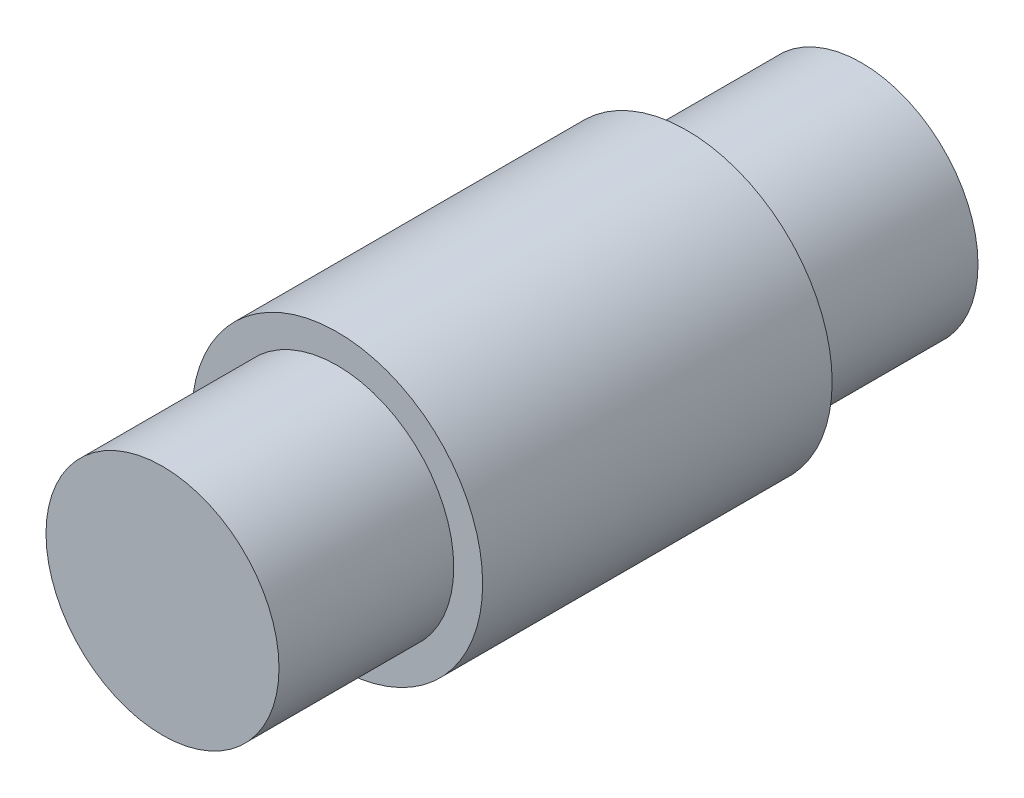
ISO-10303-21;
HEADER;
FILE_DESCRIPTION(('STEP AP214'),'2;1');
FILE_NAME('part.step','',(''),(''),'','','');
FILE_SCHEMA(('AUTOMOTIVE_DESIGN { 1 0 10303 214 1 1 1 1 }'));
ENDSEC;
DATA;
#1=APPLICATION_CONTEXT('core data for automotive mechanical design processes');
#2=APPLICATION_PROTOCOL_DEFINITION('international standard','automotive_design',2000,#1);
#3=PRODUCT_CONTEXT('',#1,'mechanical');
#4=PRODUCT('Part','Part','',(#3));
#5=PRODUCT_RELATED_PRODUCT_CATEGORY('part','',(#4));
#6=PRODUCT_DEFINITION_FORMATION('','',#4);
#7=PRODUCT_DEFINITION_CONTEXT('part definition',#1,'design');
#8=PRODUCT_DEFINITION('design','',#6,#7);
#9=PRODUCT_DEFINITION_SHAPE('','',#8);
#10=(LENGTH_UNIT() NAMED_UNIT(*) SI_UNIT(.MILLI.,.METRE.));
#11=(NAMED_UNIT(*) PLANE_ANGLE_UNIT() SI_UNIT($,.RADIAN.));
#12=(NAMED_UNIT(*) SI_UNIT($,.STERADIAN.) SOLID_ANGLE_UNIT());
#13=UNCERTAINTY_MEASURE_WITH_UNIT(LENGTH_MEASURE(1.E-05),#10,'distance_accuracy_value','');
#14=(GEOMETRIC_REPRESENTATION_CONTEXT(3) GLOBAL_UNCERTAINTY_ASSIGNED_CONTEXT((#13)) GLOBAL_UNIT_ASSIGNED_CONTEXT((#10,
#11,#12)) REPRESENTATION_CONTEXT('',''));
#15=CARTESIAN_POINT('',(0.,0.,0.));
#16=DIRECTION('',(0.,0.,1.));
#17=DIRECTION('',(1.,0.,0.));
#18=AXIS2_PLACEMENT_3D('',#15,#16,#17);
#19=CARTESIAN_POINT('',(0.,0.,4.7625));
#20=DIRECTION('',(0.,0.,-1.));
#21=DIRECTION('',(-1.,0.,0.));
#22=AXIS2_PLACEMENT_3D('',#19,#20,#21);
#23=CYLINDRICAL_SURFACE('',#22,3.9624);
#24=CARTESIAN_POINT('',(0.,0.,4.7625));
#25=DIRECTION('',(0.,0.,1.));
#26=DIRECTION('',(1.,0.,0.));
#27=AXIS2_PLACEMENT_3D('',#24,#25,#26);
#28=CIRCLE('',#27,3.9624);
#29=CARTESIAN_POINT('',(3.9624,0.,4.7625));
#30=VERTEX_POINT('',#29);
#31=EDGE_CURVE('E44',#30,#30,#28,.T.);
#32=ORIENTED_EDGE('',*,*,#31,.F.);
#33=EDGE_LOOP('',(#32));
#34=FACE_BOUND('',#33,.T.);
#35=CARTESIAN_POINT('',(0.,0.,-4.7625));
#36=DIRECTION('',(0.,0.,1.));
#37=DIRECTION('',(1.,0.,0.));
#38=AXIS2_PLACEMENT_3D('',#35,#36,#37);
#39=CIRCLE('',#38,3.9624);
#40=CARTESIAN_POINT('',(3.9624,0.,-4.7625));
#41=VERTEX_POINT('',#40);
#42=EDGE_CURVE('E49',#41,#41,#39,.T.);
#43=ORIENTED_EDGE('',*,*,#42,.T.);
#44=EDGE_LOOP('',(#43));
#45=FACE_BOUND('',#44,.T.);
#46=ADVANCED_FACE('F37',(#34,#45),#23,.T.);
#47=CARTESIAN_POINT('',(0.,0.,4.7625));
#48=DIRECTION('',(0.,0.,1.));
#49=DIRECTION('',(1.,0.,0.));
#50=AXIS2_PLACEMENT_3D('',#47,#48,#49);
#51=PLANE('',#50);
#52=CARTESIAN_POINT('',(0.,0.,4.7625));
#53=DIRECTION('',(0.,0.,1.));
#54=DIRECTION('',(1.,0.,0.));
#55=AXIS2_PLACEMENT_3D('',#52,#53,#54);
#56=CIRCLE('',#55,3.175);
#57=CARTESIAN_POINT('',(3.175,0.,4.7625));
#58=VERTEX_POINT('',#57);
#59=EDGE_CURVE('E55',#58,#58,#56,.F.);
#60=ORIENTED_EDGE('',*,*,#59,.T.);
#61=EDGE_LOOP('',(#60));
#62=FACE_BOUND('',#61,.T.);
#63=ORIENTED_EDGE('',*,*,#31,.T.);
#64=EDGE_LOOP('',(#63));
#65=FACE_BOUND('',#64,.T.);
#66=ADVANCED_FACE('F87',(#62,#65),#51,.T.);
#67=CARTESIAN_POINT('',(0.,0.,-4.7625));
#68=DIRECTION('',(0.,0.,1.));
#69=DIRECTION('',(1.,0.,0.));
#70=AXIS2_PLACEMENT_3D('',#67,#68,#69);
#71=PLANE('',#70);
#72=CARTESIAN_POINT('',(0.,0.,-4.7625));
#73=DIRECTION('',(0.,0.,1.));
#74=DIRECTION('',(1.,0.,0.));
#75=AXIS2_PLACEMENT_3D('',#72,#73,#74);
#76=CIRCLE('',#75,3.175);
#77=CARTESIAN_POINT('',(3.175,0.,-4.7625));
#78=VERTEX_POINT('',#77);
#79=EDGE_CURVE('E10',#78,#78,#76,.F.);
#80=ORIENTED_EDGE('',*,*,#79,.F.);
#81=EDGE_LOOP('',(#80));
#82=FACE_BOUND('',#81,.T.);
#83=ORIENTED_EDGE('',*,*,#42,.F.);
#84=EDGE_LOOP('',(#83));
#85=FACE_BOUND('',#84,.T.);
#86=ADVANCED_FACE('F92',(#82,#85),#71,.F.);
#87=CARTESIAN_POINT('',(0.,0.,-9.525));
#88=DIRECTION('',(0.,0.,1.));
#89=DIRECTION('',(1.,0.,0.));
#90=AXIS2_PLACEMENT_3D('',#87,#88,#89);
#91=PLANE('',#90);
#92=CARTESIAN_POINT('',(0.,0.,-9.525));
#93=DIRECTION('',(0.,0.,1.));
#94=DIRECTION('',(1.,0.,0.));
#95=AXIS2_PLACEMENT_3D('',#92,#93,#94);
#96=CIRCLE('',#95,3.175);
#97=CARTESIAN_POINT('',(3.175,0.,-9.525));
#98=VERTEX_POINT('',#97);
#99=EDGE_CURVE('E61',#98,#98,#96,.T.);
#100=ORIENTED_EDGE('',*,*,#99,.F.);
#101=EDGE_LOOP('',(#100));
#102=FACE_BOUND('',#101,.T.);
#103=ADVANCED_FACE('F81',(#102),#91,.F.);
#104=CARTESIAN_POINT('',(0.,0.,9.525));
#105=DIRECTION('',(0.,0.,-1.));
#106=DIRECTION('',(-1.,0.,0.));
#107=AXIS2_PLACEMENT_3D('',#104,#105,#106);
#108=CYLINDRICAL_SURFACE('',#107,3.175);
#109=ORIENTED_EDGE('',*,*,#99,.T.);
#110=EDGE_LOOP('',(#109));
#111=FACE_BOUND('',#110,.T.);
#112=ORIENTED_EDGE('',*,*,#79,.T.);
#113=EDGE_LOOP('',(#112));
#114=FACE_BOUND('',#113,.T.);
#115=ADVANCED_FACE('F73',(#111,#114),#108,.T.);
#116=ORIENTED_EDGE('',*,*,#59,.F.);
#117=EDGE_LOOP('',(#116));
#118=FACE_BOUND('',#117,.T.);
#119=CARTESIAN_POINT('',(0.,0.,9.525));
#120=DIRECTION('',(0.,0.,1.));
#121=DIRECTION('',(1.,0.,0.));
#122=AXIS2_PLACEMENT_3D('',#119,#120,#121);
#123=CIRCLE('',#122,3.175);
#124=CARTESIAN_POINT('',(3.175,0.,9.525));
#125=VERTEX_POINT('',#124);
#126=EDGE_CURVE('E60',#125,#125,#123,.T.);
#127=ORIENTED_EDGE('',*,*,#126,.F.);
#128=EDGE_LOOP('',(#127));
#129=FACE_BOUND('',#128,.T.);
#130=ADVANCED_FACE('F71',(#118,#129),#108,.T.);
#131=CARTESIAN_POINT('',(0.,0.,9.525));
#132=DIRECTION('',(0.,0.,1.));
#133=DIRECTION('',(1.,0.,0.));
#134=AXIS2_PLACEMENT_3D('',#131,#132,#133);
#135=PLANE('',#134);
#136=ORIENTED_EDGE('',*,*,#126,.T.);
#137=EDGE_LOOP('',(#136));
#138=FACE_BOUND('',#137,.T.);
#139=ADVANCED_FACE('F69',(#138),#135,.T.);
#140=CLOSED_SHELL('',(#46,#66,#86,#103,#115,#130,#139));
#141=MANIFOLD_SOLID_BREP('B2',#140);
#142=ADVANCED_BREP_SHAPE_REPRESENTATION('',(#18,#141),#14);
#143=SHAPE_DEFINITION_REPRESENTATION(#9,#142);
ENDSEC;
END-ISO-10303-21;
